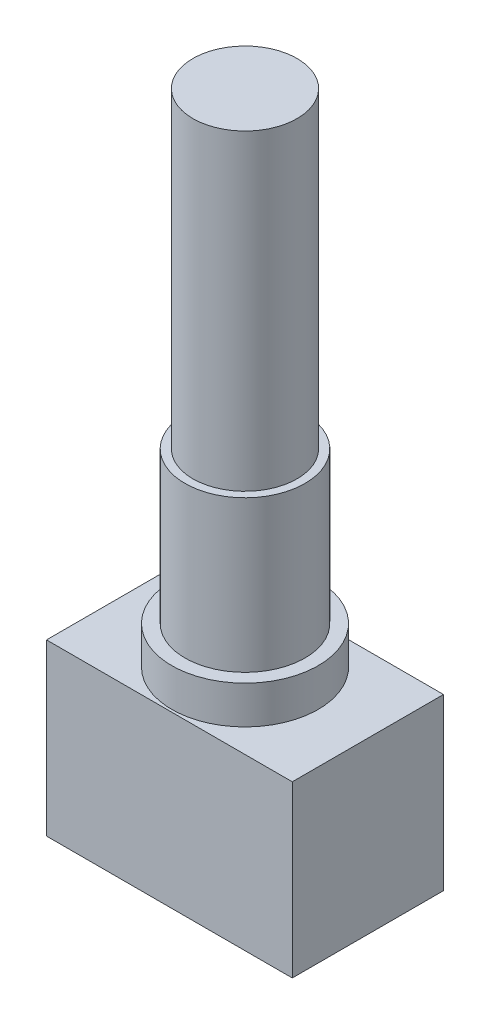
ISO-10303-21;
HEADER;
FILE_DESCRIPTION(('STEP AP214'),'2;1');
FILE_NAME('part.step','',(''),(''),'','','');
FILE_SCHEMA(('AUTOMOTIVE_DESIGN { 1 0 10303 214 1 1 1 1 }'));
ENDSEC;
DATA;
#1=APPLICATION_CONTEXT('core data for automotive mechanical design processes');
#2=APPLICATION_PROTOCOL_DEFINITION('international standard','automotive_design',2000,#1);
#3=PRODUCT_CONTEXT('',#1,'mechanical');
#4=PRODUCT('Part','Part','',(#3));
#5=PRODUCT_RELATED_PRODUCT_CATEGORY('part','',(#4));
#6=PRODUCT_DEFINITION_FORMATION('','',#4);
#7=PRODUCT_DEFINITION_CONTEXT('part definition',#1,'design');
#8=PRODUCT_DEFINITION('design','',#6,#7);
#9=PRODUCT_DEFINITION_SHAPE('','',#8);
#10=(LENGTH_UNIT() NAMED_UNIT(*) SI_UNIT(.MILLI.,.METRE.));
#11=(NAMED_UNIT(*) PLANE_ANGLE_UNIT() SI_UNIT($,.RADIAN.));
#12=(NAMED_UNIT(*) SI_UNIT($,.STERADIAN.) SOLID_ANGLE_UNIT());
#13=UNCERTAINTY_MEASURE_WITH_UNIT(LENGTH_MEASURE(1.E-05),#10,'distance_accuracy_value','');
#14=(GEOMETRIC_REPRESENTATION_CONTEXT(3) GLOBAL_UNCERTAINTY_ASSIGNED_CONTEXT((#13)) GLOBAL_UNIT_ASSIGNED_CONTEXT((#10,
#11,#12)) REPRESENTATION_CONTEXT('',''));
#15=CARTESIAN_POINT('',(0.,0.,0.));
#16=DIRECTION('',(0.,0.,1.));
#17=DIRECTION('',(1.,0.,0.));
#18=AXIS2_PLACEMENT_3D('',#15,#16,#17);
#19=CARTESIAN_POINT('',(-6.5024,0.,4.0005));
#20=DIRECTION('',(1.,0.,0.));
#21=DIRECTION('',(0.,1.,0.));
#22=AXIS2_PLACEMENT_3D('',#19,#20,#21);
#23=PLANE('',#22);
#24=DIRECTION('',(0.,-1.,0.));
#25=VECTOR('',#24,1.);
#26=CARTESIAN_POINT('',(-6.5024,0.,-4.0005));
#27=LINE('',#26,#25);
#28=CARTESIAN_POINT('',(-6.5024,0.,-4.0005));
#29=VERTEX_POINT('',#28);
#30=CARTESIAN_POINT('',(-6.5024,-8.99159999999999,-4.0005));
#31=VERTEX_POINT('',#30);
#32=EDGE_CURVE('E105',#29,#31,#27,.T.);
#33=ORIENTED_EDGE('',*,*,#32,.T.);
#34=DIRECTION('',(0.,0.,-1.));
#35=VECTOR('',#34,1.);
#36=CARTESIAN_POINT('',(-6.5024,-8.99159999999999,4.0005));
#37=LINE('',#36,#35);
#38=CARTESIAN_POINT('',(-6.5024,-8.99159999999999,4.0005));
#39=VERTEX_POINT('',#38);
#40=EDGE_CURVE('E42',#39,#31,#37,.T.);
#41=ORIENTED_EDGE('',*,*,#40,.F.);
#42=DIRECTION('',(0.,-1.,0.));
#43=VECTOR('',#42,1.);
#44=CARTESIAN_POINT('',(-6.5024,0.,4.0005));
#45=LINE('',#44,#43);
#46=CARTESIAN_POINT('',(-6.5024,0.,4.0005));
#47=VERTEX_POINT('',#46);
#48=EDGE_CURVE('E92',#47,#39,#45,.T.);
#49=ORIENTED_EDGE('',*,*,#48,.F.);
#50=DIRECTION('',(0.,0.,-1.));
#51=VECTOR('',#50,1.);
#52=CARTESIAN_POINT('',(-6.5024,0.,4.0005));
#53=LINE('',#52,#51);
#54=EDGE_CURVE('E101',#47,#29,#53,.T.);
#55=ORIENTED_EDGE('',*,*,#54,.T.);
#56=EDGE_LOOP('',(#33,#41,#49,#55));
#57=FACE_BOUND('',#56,.T.);
#58=ADVANCED_FACE('F39',(#57),#23,.F.);
#59=CARTESIAN_POINT('',(-6.5024,-8.99159999999999,4.0005));
#60=DIRECTION('',(0.,1.,0.));
#61=DIRECTION('',(0.,0.,1.));
#62=AXIS2_PLACEMENT_3D('',#59,#60,#61);
#63=PLANE('',#62);
#64=DIRECTION('',(1.,0.,0.));
#65=VECTOR('',#64,1.);
#66=CARTESIAN_POINT('',(-6.5024,-8.99159999999999,-4.0005));
#67=LINE('',#66,#65);
#68=CARTESIAN_POINT('',(6.5024,-8.99159999999999,-4.0005));
#69=VERTEX_POINT('',#68);
#70=EDGE_CURVE('E97',#31,#69,#67,.T.);
#71=ORIENTED_EDGE('',*,*,#70,.T.);
#72=DIRECTION('',(0.,0.,-1.));
#73=VECTOR('',#72,1.);
#74=CARTESIAN_POINT('',(6.5024,-8.99159999999999,4.0005));
#75=LINE('',#74,#73);
#76=CARTESIAN_POINT('',(6.5024,-8.99159999999999,4.0005));
#77=VERTEX_POINT('',#76);
#78=EDGE_CURVE('E95',#77,#69,#75,.T.);
#79=ORIENTED_EDGE('',*,*,#78,.F.);
#80=DIRECTION('',(1.,0.,0.));
#81=VECTOR('',#80,1.);
#82=CARTESIAN_POINT('',(-6.5024,-8.99159999999999,4.0005));
#83=LINE('',#82,#81);
#84=EDGE_CURVE('E87',#39,#77,#83,.T.);
#85=ORIENTED_EDGE('',*,*,#84,.F.);
#86=ORIENTED_EDGE('',*,*,#40,.T.);
#87=EDGE_LOOP('',(#71,#79,#85,#86));
#88=FACE_BOUND('',#87,.T.);
#89=ADVANCED_FACE('F96',(#88),#63,.F.);
#90=CARTESIAN_POINT('',(6.5024,0.,4.0005));
#91=DIRECTION('',(-1.,0.,0.));
#92=DIRECTION('',(0.,-1.,0.));
#93=AXIS2_PLACEMENT_3D('',#90,#91,#92);
#94=PLANE('',#93);
#95=DIRECTION('',(0.,1.,0.));
#96=VECTOR('',#95,1.);
#97=CARTESIAN_POINT('',(6.5024,0.,-4.0005));
#98=LINE('',#97,#96);
#99=CARTESIAN_POINT('',(6.5024,0.,-4.0005));
#100=VERTEX_POINT('',#99);
#101=EDGE_CURVE('E73',#69,#100,#98,.T.);
#102=ORIENTED_EDGE('',*,*,#101,.T.);
#103=DIRECTION('',(0.,0.,-1.));
#104=VECTOR('',#103,1.);
#105=CARTESIAN_POINT('',(6.5024,0.,4.0005));
#106=LINE('',#105,#104);
#107=CARTESIAN_POINT('',(6.5024,0.,4.0005));
#108=VERTEX_POINT('',#107);
#109=EDGE_CURVE('E98',#108,#100,#106,.T.);
#110=ORIENTED_EDGE('',*,*,#109,.F.);
#111=DIRECTION('',(0.,1.,0.));
#112=VECTOR('',#111,1.);
#113=CARTESIAN_POINT('',(6.5024,0.,4.0005));
#114=LINE('',#113,#112);
#115=EDGE_CURVE('E90',#77,#108,#114,.T.);
#116=ORIENTED_EDGE('',*,*,#115,.F.);
#117=ORIENTED_EDGE('',*,*,#78,.T.);
#118=EDGE_LOOP('',(#102,#110,#116,#117));
#119=FACE_BOUND('',#118,.T.);
#120=ADVANCED_FACE('F99',(#119),#94,.F.);
#121=CARTESIAN_POINT('',(-6.5024,0.,4.0005));
#122=DIRECTION('',(0.,-1.,0.));
#123=DIRECTION('',(1.,0.,0.));
#124=AXIS2_PLACEMENT_3D('',#121,#122,#123);
#125=PLANE('',#124);
#126=CARTESIAN_POINT('',(0.,0.,0.));
#127=DIRECTION('',(0.,-1.,0.));
#128=DIRECTION('',(0.,0.,-1.));
#129=AXIS2_PLACEMENT_3D('',#126,#127,#128);
#130=CIRCLE('',#129,3.875);
#131=CARTESIAN_POINT('',(0.,0.,-3.875));
#132=VERTEX_POINT('',#131);
#133=EDGE_CURVE('E108',#132,#132,#130,.T.);
#134=ORIENTED_EDGE('',*,*,#133,.T.);
#135=EDGE_LOOP('',(#134));
#136=FACE_BOUND('',#135,.T.);
#137=DIRECTION('',(-1.,0.,0.));
#138=VECTOR('',#137,1.);
#139=CARTESIAN_POINT('',(-6.5024,0.,-4.0005));
#140=LINE('',#139,#138);
#141=EDGE_CURVE('E79',#100,#29,#140,.T.);
#142=ORIENTED_EDGE('',*,*,#141,.T.);
#143=ORIENTED_EDGE('',*,*,#54,.F.);
#144=DIRECTION('',(-1.,0.,0.));
#145=VECTOR('',#144,1.);
#146=CARTESIAN_POINT('',(-6.5024,0.,4.0005));
#147=LINE('',#146,#145);
#148=EDGE_CURVE('E56',#108,#47,#147,.T.);
#149=ORIENTED_EDGE('',*,*,#148,.F.);
#150=ORIENTED_EDGE('',*,*,#109,.T.);
#151=EDGE_LOOP('',(#142,#143,#149,#150));
#152=FACE_BOUND('',#151,.T.);
#153=ADVANCED_FACE('F113',(#136,#152),#125,.F.);
#154=CARTESIAN_POINT('',(0.,0.,4.0005));
#155=DIRECTION('',(0.,0.,1.));
#156=DIRECTION('',(1.,0.,0.));
#157=AXIS2_PLACEMENT_3D('',#154,#155,#156);
#158=PLANE('',#157);
#159=ORIENTED_EDGE('',*,*,#48,.T.);
#160=ORIENTED_EDGE('',*,*,#84,.T.);
#161=ORIENTED_EDGE('',*,*,#115,.T.);
#162=ORIENTED_EDGE('',*,*,#148,.T.);
#163=EDGE_LOOP('',(#159,#160,#161,#162));
#164=FACE_BOUND('',#163,.T.);
#165=ADVANCED_FACE('F88',(#164),#158,.T.);
#166=CARTESIAN_POINT('',(0.,0.,-4.0005));
#167=DIRECTION('',(0.,0.,1.));
#168=DIRECTION('',(1.,0.,0.));
#169=AXIS2_PLACEMENT_3D('',#166,#167,#168);
#170=PLANE('',#169);
#171=ORIENTED_EDGE('',*,*,#32,.F.);
#172=ORIENTED_EDGE('',*,*,#141,.F.);
#173=ORIENTED_EDGE('',*,*,#101,.F.);
#174=ORIENTED_EDGE('',*,*,#70,.F.);
#175=EDGE_LOOP('',(#171,#172,#173,#174));
#176=FACE_BOUND('',#175,.T.);
#177=ADVANCED_FACE('F116',(#176),#170,.F.);
#178=CARTESIAN_POINT('',(-3.175,10.0076,0.));
#179=DIRECTION('',(0.,-1.,0.));
#180=DIRECTION('',(0.,0.,-1.));
#181=AXIS2_PLACEMENT_3D('',#178,#179,#180);
#182=PLANE('',#181);
#183=CARTESIAN_POINT('',(0.,10.0076,0.));
#184=DIRECTION('',(0.,1.,0.));
#185=DIRECTION('',(0.,0.,1.));
#186=AXIS2_PLACEMENT_3D('',#183,#184,#185);
#187=CIRCLE('',#186,2.7559);
#188=CARTESIAN_POINT('',(0.,10.0076,2.7559));
#189=VERTEX_POINT('',#188);
#190=EDGE_CURVE('E11',#189,#189,#187,.T.);
#191=ORIENTED_EDGE('',*,*,#190,.F.);
#192=EDGE_LOOP('',(#191));
#193=FACE_BOUND('',#192,.T.);
#194=CARTESIAN_POINT('',(0.,10.0076,0.));
#195=DIRECTION('',(0.,-1.,0.));
#196=DIRECTION('',(0.,0.,-1.));
#197=AXIS2_PLACEMENT_3D('',#194,#195,#196);
#198=CIRCLE('',#197,3.175);
#199=CARTESIAN_POINT('',(0.,10.0076,-3.175));
#200=VERTEX_POINT('',#199);
#201=EDGE_CURVE('E127',#200,#200,#198,.T.);
#202=ORIENTED_EDGE('',*,*,#201,.F.);
#203=EDGE_LOOP('',(#202));
#204=FACE_BOUND('',#203,.T.);
#205=ADVANCED_FACE('F143',(#193,#204),#182,.F.);
#206=CARTESIAN_POINT('',(0.,0.,0.));
#207=DIRECTION('',(0.,-1.,0.));
#208=DIRECTION('',(0.,0.,-1.));
#209=AXIS2_PLACEMENT_3D('',#206,#207,#208);
#210=CYLINDRICAL_SURFACE('',#209,3.875);
#211=ORIENTED_EDGE('',*,*,#133,.F.);
#212=EDGE_LOOP('',(#211));
#213=FACE_BOUND('',#212,.T.);
#214=CARTESIAN_POINT('',(0.,2.0066,0.));
#215=DIRECTION('',(0.,-1.,0.));
#216=DIRECTION('',(0.,0.,-1.));
#217=AXIS2_PLACEMENT_3D('',#214,#215,#216);
#218=CIRCLE('',#217,3.875);
#219=CARTESIAN_POINT('',(0.,2.0066,-3.875));
#220=VERTEX_POINT('',#219);
#221=EDGE_CURVE('E121',#220,#220,#218,.T.);
#222=ORIENTED_EDGE('',*,*,#221,.T.);
#223=EDGE_LOOP('',(#222));
#224=FACE_BOUND('',#223,.T.);
#225=ADVANCED_FACE('F146',(#213,#224),#210,.T.);
#226=CARTESIAN_POINT('',(-3.175,2.0066,0.));
#227=DIRECTION('',(0.,-1.,0.));
#228=DIRECTION('',(0.,0.,-1.));
#229=AXIS2_PLACEMENT_3D('',#226,#227,#228);
#230=PLANE('',#229);
#231=ORIENTED_EDGE('',*,*,#221,.F.);
#232=EDGE_LOOP('',(#231));
#233=FACE_BOUND('',#232,.T.);
#234=CARTESIAN_POINT('',(0.,2.0066,0.));
#235=DIRECTION('',(0.,-1.,0.));
#236=DIRECTION('',(0.,0.,-1.));
#237=AXIS2_PLACEMENT_3D('',#234,#235,#236);
#238=CIRCLE('',#237,3.175);
#239=CARTESIAN_POINT('',(0.,2.0066,-3.175));
#240=VERTEX_POINT('',#239);
#241=EDGE_CURVE('E124',#240,#240,#238,.T.);
#242=ORIENTED_EDGE('',*,*,#241,.T.);
#243=EDGE_LOOP('',(#242));
#244=FACE_BOUND('',#243,.T.);
#245=ADVANCED_FACE('F151',(#233,#244),#230,.F.);
#246=CARTESIAN_POINT('',(0.,0.,0.));
#247=DIRECTION('',(0.,-1.,0.));
#248=DIRECTION('',(0.,0.,-1.));
#249=AXIS2_PLACEMENT_3D('',#246,#247,#248);
#250=CYLINDRICAL_SURFACE('',#249,3.175);
#251=ORIENTED_EDGE('',*,*,#241,.F.);
#252=EDGE_LOOP('',(#251));
#253=FACE_BOUND('',#252,.T.);
#254=ORIENTED_EDGE('',*,*,#201,.T.);
#255=EDGE_LOOP('',(#254));
#256=FACE_BOUND('',#255,.T.);
#257=ADVANCED_FACE('F139',(#253,#256),#250,.T.);
#258=CARTESIAN_POINT('',(0.,26.5176,0.));
#259=DIRECTION('',(0.,-1.,0.));
#260=DIRECTION('',(0.,0.,-1.));
#261=AXIS2_PLACEMENT_3D('',#258,#259,#260);
#262=CYLINDRICAL_SURFACE('',#261,2.7559);
#263=CARTESIAN_POINT('',(0.,26.5176,0.));
#264=DIRECTION('',(0.,1.,0.));
#265=DIRECTION('',(0.,0.,1.));
#266=AXIS2_PLACEMENT_3D('',#263,#264,#265);
#267=CIRCLE('',#266,2.7559);
#268=CARTESIAN_POINT('',(0.,26.5176,2.7559));
#269=VERTEX_POINT('',#268);
#270=EDGE_CURVE('E129',#269,#269,#267,.T.);
#271=ORIENTED_EDGE('',*,*,#270,.F.);
#272=EDGE_LOOP('',(#271));
#273=FACE_BOUND('',#272,.T.);
#274=ORIENTED_EDGE('',*,*,#190,.T.);
#275=EDGE_LOOP('',(#274));
#276=FACE_BOUND('',#275,.T.);
#277=ADVANCED_FACE('F136',(#273,#276),#262,.T.);
#278=CARTESIAN_POINT('',(0.,26.5176,0.));
#279=DIRECTION('',(0.,1.,0.));
#280=DIRECTION('',(0.,0.,1.));
#281=AXIS2_PLACEMENT_3D('',#278,#279,#280);
#282=PLANE('',#281);
#283=ORIENTED_EDGE('',*,*,#270,.T.);
#284=EDGE_LOOP('',(#283));
#285=FACE_BOUND('',#284,.T.);
#286=ADVANCED_FACE('F134',(#285),#282,.T.);
#287=CLOSED_SHELL('',(#58,#89,#120,#153,#165,#177,#205,#225,#245,#257,#277,#286));
#288=MANIFOLD_SOLID_BREP('B2',#287);
#289=ADVANCED_BREP_SHAPE_REPRESENTATION('',(#18,#288),#14);
#290=SHAPE_DEFINITION_REPRESENTATION(#9,#289);
ENDSEC;
END-ISO-10303-21;
